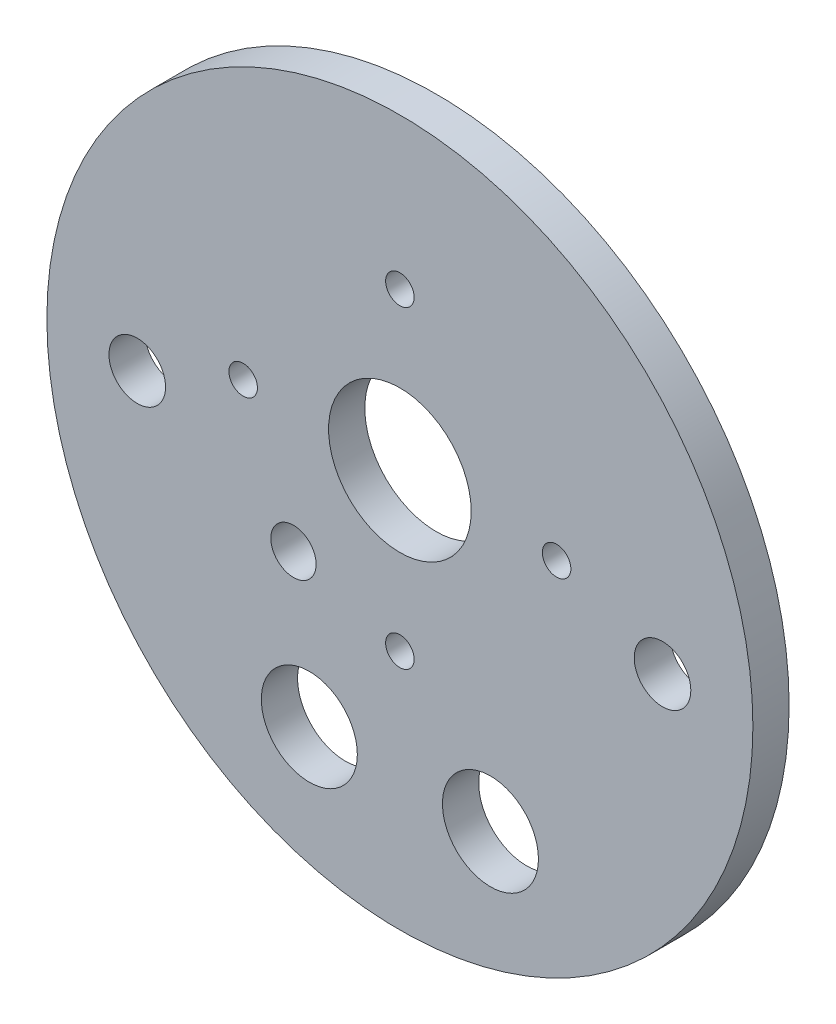
ISO-10303-21;
HEADER;
FILE_DESCRIPTION(('STEP AP214'),'2;1');
FILE_NAME('part.step','',(''),(''),'','','');
FILE_SCHEMA(('AUTOMOTIVE_DESIGN { 1 0 10303 214 1 1 1 1 }'));
ENDSEC;
DATA;
#1=APPLICATION_CONTEXT('core data for automotive mechanical design processes');
#2=APPLICATION_PROTOCOL_DEFINITION('international standard','automotive_design',2000,#1);
#3=PRODUCT_CONTEXT('',#1,'mechanical');
#4=PRODUCT('Part','Part','',(#3));
#5=PRODUCT_RELATED_PRODUCT_CATEGORY('part','',(#4));
#6=PRODUCT_DEFINITION_FORMATION('','',#4);
#7=PRODUCT_DEFINITION_CONTEXT('part definition',#1,'design');
#8=PRODUCT_DEFINITION('design','',#6,#7);
#9=PRODUCT_DEFINITION_SHAPE('','',#8);
#10=(LENGTH_UNIT() NAMED_UNIT(*) SI_UNIT(.MILLI.,.METRE.));
#11=(NAMED_UNIT(*) PLANE_ANGLE_UNIT() SI_UNIT($,.RADIAN.));
#12=(NAMED_UNIT(*) SI_UNIT($,.STERADIAN.) SOLID_ANGLE_UNIT());
#13=UNCERTAINTY_MEASURE_WITH_UNIT(LENGTH_MEASURE(1.E-05),#10,'distance_accuracy_value','');
#14=(GEOMETRIC_REPRESENTATION_CONTEXT(3) GLOBAL_UNCERTAINTY_ASSIGNED_CONTEXT((#13)) GLOBAL_UNIT_ASSIGNED_CONTEXT((#10,
#11,#12)) REPRESENTATION_CONTEXT('',''));
#15=CARTESIAN_POINT('',(0.,0.,0.));
#16=DIRECTION('',(0.,0.,1.));
#17=DIRECTION('',(1.,0.,0.));
#18=AXIS2_PLACEMENT_3D('',#15,#16,#17);
#19=CARTESIAN_POINT('',(-12.7,-31.1667936271924,0.));
#20=DIRECTION('',(0.,0.,1.));
#21=DIRECTION('',(1.,0.,0.));
#22=AXIS2_PLACEMENT_3D('',#19,#20,#21);
#23=CYLINDRICAL_SURFACE('',#22,6.731);
#24=CARTESIAN_POINT('',(-12.7,-31.1667936271924,0.));
#25=DIRECTION('',(0.,0.,1.));
#26=DIRECTION('',(1.,0.,0.));
#27=AXIS2_PLACEMENT_3D('',#24,#25,#26);
#28=CIRCLE('',#27,6.731);
#29=CARTESIAN_POINT('',(-5.969,-31.1667936271924,0.));
#30=VERTEX_POINT('',#29);
#31=EDGE_CURVE('E45',#30,#30,#28,.T.);
#32=ORIENTED_EDGE('',*,*,#31,.F.);
#33=EDGE_LOOP('',(#32));
#34=FACE_BOUND('',#33,.T.);
#35=CARTESIAN_POINT('',(-12.7,-31.1667936271924,5.08));
#36=DIRECTION('',(0.,0.,1.));
#37=DIRECTION('',(1.,0.,0.));
#38=AXIS2_PLACEMENT_3D('',#35,#36,#37);
#39=CIRCLE('',#38,6.731);
#40=CARTESIAN_POINT('',(-5.969,-31.1667936271924,5.08));
#41=VERTEX_POINT('',#40);
#42=EDGE_CURVE('E76',#41,#41,#39,.F.);
#43=ORIENTED_EDGE('',*,*,#42,.F.);
#44=EDGE_LOOP('',(#43));
#45=FACE_BOUND('',#44,.T.);
#46=ADVANCED_FACE('F32',(#34,#45),#23,.F.);
#47=CARTESIAN_POINT('',(0.,6.35,0.));
#48=DIRECTION('',(0.,0.,1.));
#49=DIRECTION('',(1.,0.,0.));
#50=AXIS2_PLACEMENT_3D('',#47,#48,#49);
#51=CYLINDRICAL_SURFACE('',#50,10.);
#52=CARTESIAN_POINT('',(0.,6.35,0.));
#53=DIRECTION('',(0.,0.,1.));
#54=DIRECTION('',(1.,0.,0.));
#55=AXIS2_PLACEMENT_3D('',#52,#53,#54);
#56=CIRCLE('',#55,10.);
#57=CARTESIAN_POINT('',(10.,6.35,0.));
#58=VERTEX_POINT('',#57);
#59=EDGE_CURVE('E71',#58,#58,#56,.T.);
#60=ORIENTED_EDGE('',*,*,#59,.F.);
#61=EDGE_LOOP('',(#60));
#62=FACE_BOUND('',#61,.T.);
#63=CARTESIAN_POINT('',(0.,6.35,5.08));
#64=DIRECTION('',(0.,0.,1.));
#65=DIRECTION('',(1.,0.,0.));
#66=AXIS2_PLACEMENT_3D('',#63,#64,#65);
#67=CIRCLE('',#66,10.);
#68=CARTESIAN_POINT('',(10.,6.35,5.08));
#69=VERTEX_POINT('',#68);
#70=EDGE_CURVE('E79',#69,#69,#67,.F.);
#71=ORIENTED_EDGE('',*,*,#70,.F.);
#72=EDGE_LOOP('',(#71));
#73=FACE_BOUND('',#72,.T.);
#74=ADVANCED_FACE('F125',(#62,#73),#51,.F.);
#75=CARTESIAN_POINT('',(-14.9213454566843,-10.9685752809603,0.));
#76=DIRECTION('',(0.,0.,1.));
#77=DIRECTION('',(1.,0.,0.));
#78=AXIS2_PLACEMENT_3D('',#75,#76,#77);
#79=CYLINDRICAL_SURFACE('',#78,3.175);
#80=CARTESIAN_POINT('',(-14.9213454566843,-10.9685752809603,0.));
#81=DIRECTION('',(0.,0.,1.));
#82=DIRECTION('',(1.,0.,0.));
#83=AXIS2_PLACEMENT_3D('',#80,#81,#82);
#84=CIRCLE('',#83,3.175);
#85=CARTESIAN_POINT('',(-11.7463454566843,-10.9685752809603,0.));
#86=VERTEX_POINT('',#85);
#87=EDGE_CURVE('E56',#86,#86,#84,.T.);
#88=ORIENTED_EDGE('',*,*,#87,.F.);
#89=EDGE_LOOP('',(#88));
#90=FACE_BOUND('',#89,.T.);
#91=CARTESIAN_POINT('',(-14.9213454566843,-10.9685752809603,5.08));
#92=DIRECTION('',(0.,0.,1.));
#93=DIRECTION('',(1.,0.,0.));
#94=AXIS2_PLACEMENT_3D('',#91,#92,#93);
#95=CIRCLE('',#94,3.175);
#96=CARTESIAN_POINT('',(-11.7463454566843,-10.9685752809603,5.08));
#97=VERTEX_POINT('',#96);
#98=EDGE_CURVE('E82',#97,#97,#95,.F.);
#99=ORIENTED_EDGE('',*,*,#98,.F.);
#100=EDGE_LOOP('',(#99));
#101=FACE_BOUND('',#100,.T.);
#102=ADVANCED_FACE('F131',(#90,#101),#79,.F.);
#103=CARTESIAN_POINT('',(36.83,0.,0.));
#104=DIRECTION('',(0.,0.,1.));
#105=DIRECTION('',(1.,0.,0.));
#106=AXIS2_PLACEMENT_3D('',#103,#104,#105);
#107=CYLINDRICAL_SURFACE('',#106,3.96875);
#108=CARTESIAN_POINT('',(36.83,0.,0.));
#109=DIRECTION('',(0.,0.,1.));
#110=DIRECTION('',(1.,0.,0.));
#111=AXIS2_PLACEMENT_3D('',#108,#109,#110);
#112=CIRCLE('',#111,3.96875);
#113=CARTESIAN_POINT('',(40.79875,0.,0.));
#114=VERTEX_POINT('',#113);
#115=EDGE_CURVE('E53',#114,#114,#112,.T.);
#116=ORIENTED_EDGE('',*,*,#115,.F.);
#117=EDGE_LOOP('',(#116));
#118=FACE_BOUND('',#117,.T.);
#119=CARTESIAN_POINT('',(36.83,0.,5.08));
#120=DIRECTION('',(0.,0.,1.));
#121=DIRECTION('',(1.,0.,0.));
#122=AXIS2_PLACEMENT_3D('',#119,#120,#121);
#123=CIRCLE('',#122,3.96875);
#124=CARTESIAN_POINT('',(40.79875,0.,5.08));
#125=VERTEX_POINT('',#124);
#126=EDGE_CURVE('E85',#125,#125,#123,.F.);
#127=ORIENTED_EDGE('',*,*,#126,.F.);
#128=EDGE_LOOP('',(#127));
#129=FACE_BOUND('',#128,.T.);
#130=ADVANCED_FACE('F199',(#118,#129),#107,.F.);
#131=CARTESIAN_POINT('',(-36.83,0.,0.));
#132=DIRECTION('',(0.,0.,1.));
#133=DIRECTION('',(1.,0.,0.));
#134=AXIS2_PLACEMENT_3D('',#131,#132,#133);
#135=CYLINDRICAL_SURFACE('',#134,3.96875);
#136=CARTESIAN_POINT('',(-36.83,0.,0.));
#137=DIRECTION('',(0.,0.,1.));
#138=DIRECTION('',(1.,0.,0.));
#139=AXIS2_PLACEMENT_3D('',#136,#137,#138);
#140=CIRCLE('',#139,3.96875);
#141=CARTESIAN_POINT('',(-32.86125,0.,0.));
#142=VERTEX_POINT('',#141);
#143=EDGE_CURVE('E50',#142,#142,#140,.T.);
#144=ORIENTED_EDGE('',*,*,#143,.F.);
#145=EDGE_LOOP('',(#144));
#146=FACE_BOUND('',#145,.T.);
#147=CARTESIAN_POINT('',(-36.83,0.,5.08));
#148=DIRECTION('',(0.,0.,1.));
#149=DIRECTION('',(1.,0.,0.));
#150=AXIS2_PLACEMENT_3D('',#147,#148,#149);
#151=CIRCLE('',#150,3.96875);
#152=CARTESIAN_POINT('',(-32.86125,0.,5.08));
#153=VERTEX_POINT('',#152);
#154=EDGE_CURVE('E88',#153,#153,#151,.F.);
#155=ORIENTED_EDGE('',*,*,#154,.F.);
#156=EDGE_LOOP('',(#155));
#157=FACE_BOUND('',#156,.T.);
#158=ADVANCED_FACE('F138',(#146,#157),#135,.F.);
#159=CARTESIAN_POINT('',(12.7,-31.1667936271924,0.));
#160=DIRECTION('',(0.,0.,1.));
#161=DIRECTION('',(1.,0.,0.));
#162=AXIS2_PLACEMENT_3D('',#159,#160,#161);
#163=CYLINDRICAL_SURFACE('',#162,6.731);
#164=CARTESIAN_POINT('',(12.7,-31.1667936271924,0.));
#165=DIRECTION('',(0.,0.,1.));
#166=DIRECTION('',(1.,0.,0.));
#167=AXIS2_PLACEMENT_3D('',#164,#165,#166);
#168=CIRCLE('',#167,6.731);
#169=CARTESIAN_POINT('',(19.431,-31.1667936271924,0.));
#170=VERTEX_POINT('',#169);
#171=EDGE_CURVE('E49',#170,#170,#168,.T.);
#172=ORIENTED_EDGE('',*,*,#171,.F.);
#173=EDGE_LOOP('',(#172));
#174=FACE_BOUND('',#173,.T.);
#175=CARTESIAN_POINT('',(12.7,-31.1667936271924,5.08));
#176=DIRECTION('',(0.,0.,1.));
#177=DIRECTION('',(1.,0.,0.));
#178=AXIS2_PLACEMENT_3D('',#175,#176,#177);
#179=CIRCLE('',#178,6.731);
#180=CARTESIAN_POINT('',(19.431,-31.1667936271924,5.08));
#181=VERTEX_POINT('',#180);
#182=EDGE_CURVE('E91',#181,#181,#179,.F.);
#183=ORIENTED_EDGE('',*,*,#182,.F.);
#184=EDGE_LOOP('',(#183));
#185=FACE_BOUND('',#184,.T.);
#186=ADVANCED_FACE('F189',(#174,#185),#163,.F.);
#187=CARTESIAN_POINT('',(-21.9768787592779,6.35,0.));
#188=DIRECTION('',(0.,0.,1.));
#189=DIRECTION('',(1.,0.,0.));
#190=AXIS2_PLACEMENT_3D('',#187,#188,#189);
#191=CYLINDRICAL_SURFACE('',#190,2.);
#192=CARTESIAN_POINT('',(-21.9768787592779,6.35,0.));
#193=DIRECTION('',(0.,0.,1.));
#194=DIRECTION('',(1.,0.,0.));
#195=AXIS2_PLACEMENT_3D('',#192,#193,#194);
#196=CIRCLE('',#195,2.);
#197=CARTESIAN_POINT('',(-19.9768787592779,6.35,0.));
#198=VERTEX_POINT('',#197);
#199=EDGE_CURVE('E68',#198,#198,#196,.T.);
#200=ORIENTED_EDGE('',*,*,#199,.F.);
#201=EDGE_LOOP('',(#200));
#202=FACE_BOUND('',#201,.T.);
#203=CARTESIAN_POINT('',(-21.9768787592779,6.35,5.08));
#204=DIRECTION('',(0.,0.,1.));
#205=DIRECTION('',(1.,0.,0.));
#206=AXIS2_PLACEMENT_3D('',#203,#204,#205);
#207=CIRCLE('',#206,2.);
#208=CARTESIAN_POINT('',(-19.9768787592779,6.35,5.08));
#209=VERTEX_POINT('',#208);
#210=EDGE_CURVE('E94',#209,#209,#207,.F.);
#211=ORIENTED_EDGE('',*,*,#210,.F.);
#212=EDGE_LOOP('',(#211));
#213=FACE_BOUND('',#212,.T.);
#214=ADVANCED_FACE('F183',(#202,#213),#191,.F.);
#215=CARTESIAN_POINT('',(0.,-15.6268787592779,0.));
#216=DIRECTION('',(0.,0.,1.));
#217=DIRECTION('',(1.,0.,0.));
#218=AXIS2_PLACEMENT_3D('',#215,#216,#217);
#219=CYLINDRICAL_SURFACE('',#218,2.);
#220=CARTESIAN_POINT('',(0.,-15.6268787592779,0.));
#221=DIRECTION('',(0.,0.,1.));
#222=DIRECTION('',(1.,0.,0.));
#223=AXIS2_PLACEMENT_3D('',#220,#221,#222);
#224=CIRCLE('',#223,2.);
#225=CARTESIAN_POINT('',(2.,-15.6268787592779,0.));
#226=VERTEX_POINT('',#225);
#227=EDGE_CURVE('E65',#226,#226,#224,.T.);
#228=ORIENTED_EDGE('',*,*,#227,.F.);
#229=EDGE_LOOP('',(#228));
#230=FACE_BOUND('',#229,.T.);
#231=CARTESIAN_POINT('',(0.,-15.6268787592779,5.08));
#232=DIRECTION('',(0.,0.,1.));
#233=DIRECTION('',(1.,0.,0.));
#234=AXIS2_PLACEMENT_3D('',#231,#232,#233);
#235=CIRCLE('',#234,2.);
#236=CARTESIAN_POINT('',(2.,-15.6268787592779,5.08));
#237=VERTEX_POINT('',#236);
#238=EDGE_CURVE('E97',#237,#237,#235,.F.);
#239=ORIENTED_EDGE('',*,*,#238,.F.);
#240=EDGE_LOOP('',(#239));
#241=FACE_BOUND('',#240,.T.);
#242=ADVANCED_FACE('F119',(#230,#241),#219,.F.);
#243=CARTESIAN_POINT('',(21.9768787592779,6.35,0.));
#244=DIRECTION('',(0.,0.,1.));
#245=DIRECTION('',(1.,0.,0.));
#246=AXIS2_PLACEMENT_3D('',#243,#244,#245);
#247=CYLINDRICAL_SURFACE('',#246,2.);
#248=CARTESIAN_POINT('',(21.9768787592779,6.35,0.));
#249=DIRECTION('',(0.,0.,1.));
#250=DIRECTION('',(1.,0.,0.));
#251=AXIS2_PLACEMENT_3D('',#248,#249,#250);
#252=CIRCLE('',#251,2.);
#253=CARTESIAN_POINT('',(23.9768787592779,6.35,0.));
#254=VERTEX_POINT('',#253);
#255=EDGE_CURVE('E62',#254,#254,#252,.T.);
#256=ORIENTED_EDGE('',*,*,#255,.F.);
#257=EDGE_LOOP('',(#256));
#258=FACE_BOUND('',#257,.T.);
#259=CARTESIAN_POINT('',(21.9768787592779,6.35,5.08));
#260=DIRECTION('',(0.,0.,1.));
#261=DIRECTION('',(1.,0.,0.));
#262=AXIS2_PLACEMENT_3D('',#259,#260,#261);
#263=CIRCLE('',#262,2.);
#264=CARTESIAN_POINT('',(23.9768787592779,6.35,5.08));
#265=VERTEX_POINT('',#264);
#266=EDGE_CURVE('E100',#265,#265,#263,.F.);
#267=ORIENTED_EDGE('',*,*,#266,.F.);
#268=EDGE_LOOP('',(#267));
#269=FACE_BOUND('',#268,.T.);
#270=ADVANCED_FACE('F111',(#258,#269),#247,.F.);
#271=CARTESIAN_POINT('',(0.,28.3268787592779,0.));
#272=DIRECTION('',(0.,0.,1.));
#273=DIRECTION('',(1.,0.,0.));
#274=AXIS2_PLACEMENT_3D('',#271,#272,#273);
#275=CYLINDRICAL_SURFACE('',#274,2.);
#276=CARTESIAN_POINT('',(0.,28.3268787592779,0.));
#277=DIRECTION('',(0.,0.,1.));
#278=DIRECTION('',(1.,0.,0.));
#279=AXIS2_PLACEMENT_3D('',#276,#277,#278);
#280=CIRCLE('',#279,2.);
#281=CARTESIAN_POINT('',(2.,28.3268787592779,0.));
#282=VERTEX_POINT('',#281);
#283=EDGE_CURVE('E59',#282,#282,#280,.T.);
#284=ORIENTED_EDGE('',*,*,#283,.F.);
#285=EDGE_LOOP('',(#284));
#286=FACE_BOUND('',#285,.T.);
#287=CARTESIAN_POINT('',(0.,28.3268787592779,5.08));
#288=DIRECTION('',(0.,0.,1.));
#289=DIRECTION('',(1.,0.,0.));
#290=AXIS2_PLACEMENT_3D('',#287,#288,#289);
#291=CIRCLE('',#290,2.);
#292=CARTESIAN_POINT('',(2.,28.3268787592779,5.08));
#293=VERTEX_POINT('',#292);
#294=EDGE_CURVE('E36',#293,#293,#291,.F.);
#295=ORIENTED_EDGE('',*,*,#294,.F.);
#296=EDGE_LOOP('',(#295));
#297=FACE_BOUND('',#296,.T.);
#298=ADVANCED_FACE('F109',(#286,#297),#275,.F.);
#299=CARTESIAN_POINT('',(0.,0.,5.08));
#300=DIRECTION('',(0.,0.,-1.));
#301=DIRECTION('',(-1.,0.,0.));
#302=AXIS2_PLACEMENT_3D('',#299,#300,#301);
#303=CYLINDRICAL_SURFACE('',#302,49.5046);
#304=CARTESIAN_POINT('',(0.,0.,5.08));
#305=DIRECTION('',(0.,0.,1.));
#306=DIRECTION('',(1.,0.,0.));
#307=AXIS2_PLACEMENT_3D('',#304,#305,#306);
#308=CIRCLE('',#307,49.5046);
#309=CARTESIAN_POINT('',(49.5046,0.,5.08));
#310=VERTEX_POINT('',#309);
#311=EDGE_CURVE('E10',#310,#310,#308,.T.);
#312=ORIENTED_EDGE('',*,*,#311,.F.);
#313=EDGE_LOOP('',(#312));
#314=FACE_BOUND('',#313,.T.);
#315=CARTESIAN_POINT('',(0.,0.,0.));
#316=DIRECTION('',(0.,0.,1.));
#317=DIRECTION('',(1.,0.,0.));
#318=AXIS2_PLACEMENT_3D('',#315,#316,#317);
#319=CIRCLE('',#318,49.5046);
#320=CARTESIAN_POINT('',(49.5046,0.,0.));
#321=VERTEX_POINT('',#320);
#322=EDGE_CURVE('E40',#321,#321,#319,.T.);
#323=ORIENTED_EDGE('',*,*,#322,.T.);
#324=EDGE_LOOP('',(#323));
#325=FACE_BOUND('',#324,.T.);
#326=ADVANCED_FACE('F34',(#314,#325),#303,.T.);
#327=CARTESIAN_POINT('',(0.,0.,5.08));
#328=DIRECTION('',(0.,0.,1.));
#329=DIRECTION('',(1.,0.,0.));
#330=AXIS2_PLACEMENT_3D('',#327,#328,#329);
#331=PLANE('',#330);
#332=ORIENTED_EDGE('',*,*,#311,.T.);
#333=EDGE_LOOP('',(#332));
#334=FACE_BOUND('',#333,.T.);
#335=ORIENTED_EDGE('',*,*,#42,.T.);
#336=EDGE_LOOP('',(#335));
#337=FACE_BOUND('',#336,.T.);
#338=ORIENTED_EDGE('',*,*,#70,.T.);
#339=EDGE_LOOP('',(#338));
#340=FACE_BOUND('',#339,.T.);
#341=ORIENTED_EDGE('',*,*,#98,.T.);
#342=EDGE_LOOP('',(#341));
#343=FACE_BOUND('',#342,.T.);
#344=ORIENTED_EDGE('',*,*,#126,.T.);
#345=EDGE_LOOP('',(#344));
#346=FACE_BOUND('',#345,.T.);
#347=ORIENTED_EDGE('',*,*,#154,.T.);
#348=EDGE_LOOP('',(#347));
#349=FACE_BOUND('',#348,.T.);
#350=ORIENTED_EDGE('',*,*,#182,.T.);
#351=EDGE_LOOP('',(#350));
#352=FACE_BOUND('',#351,.T.);
#353=ORIENTED_EDGE('',*,*,#210,.T.);
#354=EDGE_LOOP('',(#353));
#355=FACE_BOUND('',#354,.T.);
#356=ORIENTED_EDGE('',*,*,#238,.T.);
#357=EDGE_LOOP('',(#356));
#358=FACE_BOUND('',#357,.T.);
#359=ORIENTED_EDGE('',*,*,#266,.T.);
#360=EDGE_LOOP('',(#359));
#361=FACE_BOUND('',#360,.T.);
#362=ORIENTED_EDGE('',*,*,#294,.T.);
#363=EDGE_LOOP('',(#362));
#364=FACE_BOUND('',#363,.T.);
#365=ADVANCED_FACE('F107',(#334,#337,#340,#343,#346,#349,#352,#355,#358,#361,#364),#331,.T.);
#366=CARTESIAN_POINT('',(0.,0.,0.));
#367=DIRECTION('',(0.,0.,1.));
#368=DIRECTION('',(1.,0.,0.));
#369=AXIS2_PLACEMENT_3D('',#366,#367,#368);
#370=PLANE('',#369);
#371=ORIENTED_EDGE('',*,*,#283,.T.);
#372=EDGE_LOOP('',(#371));
#373=FACE_BOUND('',#372,.T.);
#374=ORIENTED_EDGE('',*,*,#255,.T.);
#375=EDGE_LOOP('',(#374));
#376=FACE_BOUND('',#375,.T.);
#377=ORIENTED_EDGE('',*,*,#227,.T.);
#378=EDGE_LOOP('',(#377));
#379=FACE_BOUND('',#378,.T.);
#380=ORIENTED_EDGE('',*,*,#199,.T.);
#381=EDGE_LOOP('',(#380));
#382=FACE_BOUND('',#381,.T.);
#383=ORIENTED_EDGE('',*,*,#171,.T.);
#384=EDGE_LOOP('',(#383));
#385=FACE_BOUND('',#384,.T.);
#386=ORIENTED_EDGE('',*,*,#143,.T.);
#387=EDGE_LOOP('',(#386));
#388=FACE_BOUND('',#387,.T.);
#389=ORIENTED_EDGE('',*,*,#115,.T.);
#390=EDGE_LOOP('',(#389));
#391=FACE_BOUND('',#390,.T.);
#392=ORIENTED_EDGE('',*,*,#87,.T.);
#393=EDGE_LOOP('',(#392));
#394=FACE_BOUND('',#393,.T.);
#395=ORIENTED_EDGE('',*,*,#59,.T.);
#396=EDGE_LOOP('',(#395));
#397=FACE_BOUND('',#396,.T.);
#398=ORIENTED_EDGE('',*,*,#31,.T.);
#399=EDGE_LOOP('',(#398));
#400=FACE_BOUND('',#399,.T.);
#401=ORIENTED_EDGE('',*,*,#322,.F.);
#402=EDGE_LOOP('',(#401));
#403=FACE_BOUND('',#402,.T.);
#404=ADVANCED_FACE('F141',(#373,#376,#379,#382,#385,#388,#391,#394,#397,#400,#403),#370,.F.);
#405=CLOSED_SHELL('',(#46,#74,#102,#130,#158,#186,#214,#242,#270,#298,#326,#365,#404));
#406=MANIFOLD_SOLID_BREP('B2',#405);
#407=ADVANCED_BREP_SHAPE_REPRESENTATION('',(#18,#406),#14);
#408=SHAPE_DEFINITION_REPRESENTATION(#9,#407);
ENDSEC;
END-ISO-10303-21;
